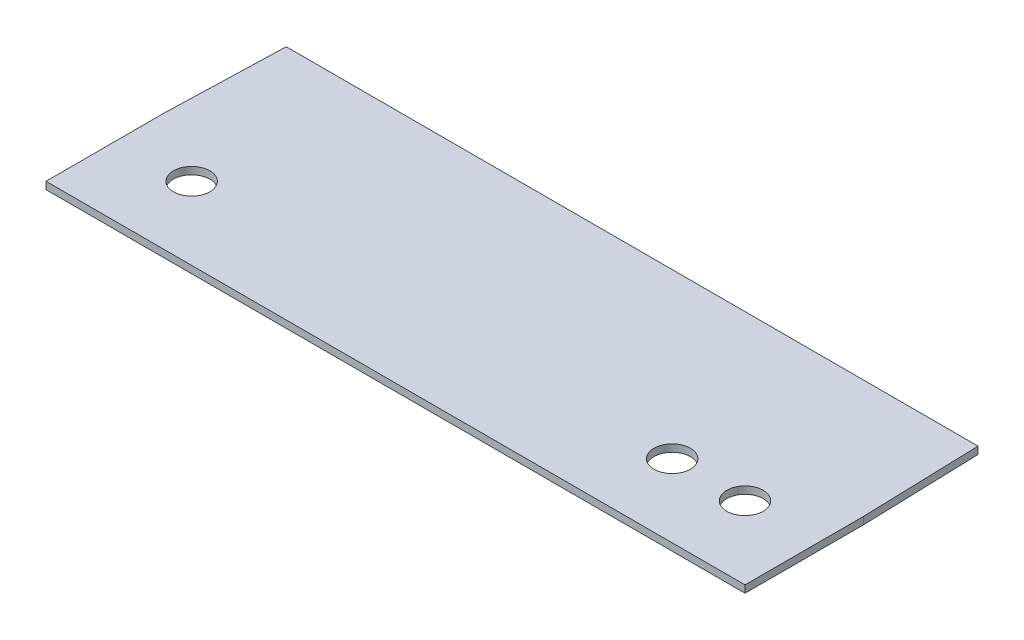
ISO-10303-21;
HEADER;
FILE_DESCRIPTION(('STEP AP214'),'2;1');
FILE_NAME('part.step','',(''),(''),'','','');
FILE_SCHEMA(('AUTOMOTIVE_DESIGN { 1 0 10303 214 1 1 1 1 }'));
ENDSEC;
DATA;
#1=APPLICATION_CONTEXT('core data for automotive mechanical design processes');
#2=APPLICATION_PROTOCOL_DEFINITION('international standard','automotive_design',2000,#1);
#3=PRODUCT_CONTEXT('',#1,'mechanical');
#4=PRODUCT('Part','Part','',(#3));
#5=PRODUCT_RELATED_PRODUCT_CATEGORY('part','',(#4));
#6=PRODUCT_DEFINITION_FORMATION('','',#4);
#7=PRODUCT_DEFINITION_CONTEXT('part definition',#1,'design');
#8=PRODUCT_DEFINITION('design','',#6,#7);
#9=PRODUCT_DEFINITION_SHAPE('','',#8);
#10=(LENGTH_UNIT() NAMED_UNIT(*) SI_UNIT(.MILLI.,.METRE.));
#11=(NAMED_UNIT(*) PLANE_ANGLE_UNIT() SI_UNIT($,.RADIAN.));
#12=(NAMED_UNIT(*) SI_UNIT($,.STERADIAN.) SOLID_ANGLE_UNIT());
#13=UNCERTAINTY_MEASURE_WITH_UNIT(LENGTH_MEASURE(1.E-05),#10,'distance_accuracy_value','');
#14=(GEOMETRIC_REPRESENTATION_CONTEXT(3) GLOBAL_UNCERTAINTY_ASSIGNED_CONTEXT((#13)) GLOBAL_UNIT_ASSIGNED_CONTEXT((#10,
#11,#12)) REPRESENTATION_CONTEXT('',''));
#15=CARTESIAN_POINT('',(0.,0.,0.));
#16=DIRECTION('',(0.,0.,1.));
#17=DIRECTION('',(1.,0.,0.));
#18=AXIS2_PLACEMENT_3D('',#15,#16,#17);
#19=CARTESIAN_POINT('',(96.,2.,0.));
#20=DIRECTION('',(-1.,0.,0.));
#21=DIRECTION('',(0.,0.,1.));
#22=AXIS2_PLACEMENT_3D('',#19,#20,#21);
#23=PLANE('',#22);
#24=DIRECTION('',(0.,0.,-1.));
#25=VECTOR('',#24,1.);
#26=CARTESIAN_POINT('',(96.,0.,0.));
#27=LINE('',#26,#25);
#28=CARTESIAN_POINT('',(96.,0.,32.5));
#29=VERTEX_POINT('',#28);
#30=CARTESIAN_POINT('',(96.,0.,0.));
#31=VERTEX_POINT('',#30);
#32=EDGE_CURVE('E130',#29,#31,#27,.T.);
#33=ORIENTED_EDGE('',*,*,#32,.T.);
#34=DIRECTION('',(0.,-1.,0.));
#35=VECTOR('',#34,1.);
#36=CARTESIAN_POINT('',(96.,2.,0.));
#37=LINE('',#36,#35);
#38=CARTESIAN_POINT('',(96.,2.,0.));
#39=VERTEX_POINT('',#38);
#40=EDGE_CURVE('E11',#39,#31,#37,.T.);
#41=ORIENTED_EDGE('',*,*,#40,.F.);
#42=DIRECTION('',(0.,0.,-1.));
#43=VECTOR('',#42,1.);
#44=CARTESIAN_POINT('',(96.,2.,0.));
#45=LINE('',#44,#43);
#46=CARTESIAN_POINT('',(96.,2.,32.5));
#47=VERTEX_POINT('',#46);
#48=EDGE_CURVE('E146',#47,#39,#45,.T.);
#49=ORIENTED_EDGE('',*,*,#48,.F.);
#50=DIRECTION('',(0.,-1.,0.));
#51=VECTOR('',#50,1.);
#52=CARTESIAN_POINT('',(96.,2.,32.5));
#53=LINE('',#52,#51);
#54=EDGE_CURVE('E126',#47,#29,#53,.T.);
#55=ORIENTED_EDGE('',*,*,#54,.T.);
#56=EDGE_LOOP('',(#33,#41,#49,#55));
#57=FACE_BOUND('',#56,.T.);
#58=ADVANCED_FACE('F39',(#57),#23,.F.);
#59=CARTESIAN_POINT('',(96.,2.,0.));
#60=DIRECTION('',(-0.999526963076654,0.,0.030754675786974));
#61=DIRECTION('',(0.030754675786974,0.,0.999526963076654));
#62=AXIS2_PLACEMENT_3D('',#59,#60,#61);
#63=PLANE('',#62);
#64=DIRECTION('',(-0.030754675786974,0.,-0.999526963076654));
#65=VECTOR('',#64,1.);
#66=CARTESIAN_POINT('',(96.,0.,0.));
#67=LINE('',#66,#65);
#68=CARTESIAN_POINT('',(95.,0.,-32.5));
#69=VERTEX_POINT('',#68);
#70=EDGE_CURVE('E134',#31,#69,#67,.T.);
#71=ORIENTED_EDGE('',*,*,#70,.T.);
#72=DIRECTION('',(0.,-1.,0.));
#73=VECTOR('',#72,1.);
#74=CARTESIAN_POINT('',(95.,2.,-32.5));
#75=LINE('',#74,#73);
#76=CARTESIAN_POINT('',(95.,2.,-32.5));
#77=VERTEX_POINT('',#76);
#78=EDGE_CURVE('E49',#77,#69,#75,.T.);
#79=ORIENTED_EDGE('',*,*,#78,.F.);
#80=DIRECTION('',(-0.030754675786974,0.,-0.999526963076654));
#81=VECTOR('',#80,1.);
#82=CARTESIAN_POINT('',(96.,2.,0.));
#83=LINE('',#82,#81);
#84=EDGE_CURVE('E95',#39,#77,#83,.T.);
#85=ORIENTED_EDGE('',*,*,#84,.F.);
#86=ORIENTED_EDGE('',*,*,#40,.T.);
#87=EDGE_LOOP('',(#71,#79,#85,#86));
#88=FACE_BOUND('',#87,.T.);
#89=ADVANCED_FACE('F184',(#88),#63,.F.);
#90=CARTESIAN_POINT('',(-95.,2.,-32.5));
#91=DIRECTION('',(0.,0.,1.));
#92=DIRECTION('',(1.,0.,0.));
#93=AXIS2_PLACEMENT_3D('',#90,#91,#92);
#94=PLANE('',#93);
#95=DIRECTION('',(-1.,0.,0.));
#96=VECTOR('',#95,1.);
#97=CARTESIAN_POINT('',(-95.,0.,-32.5));
#98=LINE('',#97,#96);
#99=CARTESIAN_POINT('',(-95.,0.,-32.5));
#100=VERTEX_POINT('',#99);
#101=EDGE_CURVE('E137',#69,#100,#98,.T.);
#102=ORIENTED_EDGE('',*,*,#101,.T.);
#103=DIRECTION('',(0.,-1.,0.));
#104=VECTOR('',#103,1.);
#105=CARTESIAN_POINT('',(-95.,2.,-32.5));
#106=LINE('',#105,#104);
#107=CARTESIAN_POINT('',(-95.,2.,-32.5));
#108=VERTEX_POINT('',#107);
#109=EDGE_CURVE('E119',#108,#100,#106,.T.);
#110=ORIENTED_EDGE('',*,*,#109,.F.);
#111=DIRECTION('',(-1.,0.,0.));
#112=VECTOR('',#111,1.);
#113=CARTESIAN_POINT('',(-95.,2.,-32.5));
#114=LINE('',#113,#112);
#115=EDGE_CURVE('E108',#77,#108,#114,.T.);
#116=ORIENTED_EDGE('',*,*,#115,.F.);
#117=ORIENTED_EDGE('',*,*,#78,.T.);
#118=EDGE_LOOP('',(#102,#110,#116,#117));
#119=FACE_BOUND('',#118,.T.);
#120=ADVANCED_FACE('F189',(#119),#94,.F.);
#121=CARTESIAN_POINT('',(-96.,2.,0.));
#122=DIRECTION('',(0.999526963076654,0.,0.030754675786974));
#123=DIRECTION('',(0.030754675786974,0.,-0.999526963076654));
#124=AXIS2_PLACEMENT_3D('',#121,#122,#123);
#125=PLANE('',#124);
#126=DIRECTION('',(-0.030754675786974,0.,0.999526963076654));
#127=VECTOR('',#126,1.);
#128=CARTESIAN_POINT('',(-96.,0.,0.));
#129=LINE('',#128,#127);
#130=CARTESIAN_POINT('',(-96.,0.,0.));
#131=VERTEX_POINT('',#130);
#132=EDGE_CURVE('E117',#100,#131,#129,.T.);
#133=ORIENTED_EDGE('',*,*,#132,.T.);
#134=DIRECTION('',(0.,-1.,0.));
#135=VECTOR('',#134,1.);
#136=CARTESIAN_POINT('',(-96.,2.,0.));
#137=LINE('',#136,#135);
#138=CARTESIAN_POINT('',(-96.,2.,0.));
#139=VERTEX_POINT('',#138);
#140=EDGE_CURVE('E114',#139,#131,#137,.T.);
#141=ORIENTED_EDGE('',*,*,#140,.F.);
#142=DIRECTION('',(-0.030754675786974,0.,0.999526963076654));
#143=VECTOR('',#142,1.);
#144=CARTESIAN_POINT('',(-96.,2.,0.));
#145=LINE('',#144,#143);
#146=EDGE_CURVE('E102',#108,#139,#145,.T.);
#147=ORIENTED_EDGE('',*,*,#146,.F.);
#148=ORIENTED_EDGE('',*,*,#109,.T.);
#149=EDGE_LOOP('',(#133,#141,#147,#148));
#150=FACE_BOUND('',#149,.T.);
#151=ADVANCED_FACE('F115',(#150),#125,.F.);
#152=CARTESIAN_POINT('',(-96.,2.,0.));
#153=DIRECTION('',(1.,0.,0.));
#154=DIRECTION('',(0.,0.,-1.));
#155=AXIS2_PLACEMENT_3D('',#152,#153,#154);
#156=PLANE('',#155);
#157=DIRECTION('',(0.,0.,1.));
#158=VECTOR('',#157,1.);
#159=CARTESIAN_POINT('',(-96.,0.,0.));
#160=LINE('',#159,#158);
#161=CARTESIAN_POINT('',(-96.,0.,32.5));
#162=VERTEX_POINT('',#161);
#163=EDGE_CURVE('E81',#131,#162,#160,.T.);
#164=ORIENTED_EDGE('',*,*,#163,.T.);
#165=DIRECTION('',(0.,-1.,0.));
#166=VECTOR('',#165,1.);
#167=CARTESIAN_POINT('',(-96.,2.,32.5));
#168=LINE('',#167,#166);
#169=CARTESIAN_POINT('',(-96.,2.,32.5));
#170=VERTEX_POINT('',#169);
#171=EDGE_CURVE('E120',#170,#162,#168,.T.);
#172=ORIENTED_EDGE('',*,*,#171,.F.);
#173=DIRECTION('',(0.,0.,1.));
#174=VECTOR('',#173,1.);
#175=CARTESIAN_POINT('',(-96.,2.,0.));
#176=LINE('',#175,#174);
#177=EDGE_CURVE('E106',#139,#170,#176,.T.);
#178=ORIENTED_EDGE('',*,*,#177,.F.);
#179=ORIENTED_EDGE('',*,*,#140,.T.);
#180=EDGE_LOOP('',(#164,#172,#178,#179));
#181=FACE_BOUND('',#180,.T.);
#182=ADVANCED_FACE('F122',(#181),#156,.F.);
#183=CARTESIAN_POINT('',(-96.,2.,32.5));
#184=DIRECTION('',(0.,0.,-1.));
#185=DIRECTION('',(-1.,0.,0.));
#186=AXIS2_PLACEMENT_3D('',#183,#184,#185);
#187=PLANE('',#186);
#188=DIRECTION('',(1.,0.,0.));
#189=VECTOR('',#188,1.);
#190=CARTESIAN_POINT('',(-96.,0.,32.5));
#191=LINE('',#190,#189);
#192=EDGE_CURVE('E87',#162,#29,#191,.T.);
#193=ORIENTED_EDGE('',*,*,#192,.T.);
#194=ORIENTED_EDGE('',*,*,#54,.F.);
#195=DIRECTION('',(1.,0.,0.));
#196=VECTOR('',#195,1.);
#197=CARTESIAN_POINT('',(-96.,2.,32.5));
#198=LINE('',#197,#196);
#199=EDGE_CURVE('E58',#170,#47,#198,.T.);
#200=ORIENTED_EDGE('',*,*,#199,.F.);
#201=ORIENTED_EDGE('',*,*,#171,.T.);
#202=EDGE_LOOP('',(#193,#194,#200,#201));
#203=FACE_BOUND('',#202,.T.);
#204=ADVANCED_FACE('F215',(#203),#187,.F.);
#205=CARTESIAN_POINT('',(0.,2.,0.));
#206=DIRECTION('',(0.,1.,0.));
#207=DIRECTION('',(0.,0.,1.));
#208=AXIS2_PLACEMENT_3D('',#205,#206,#207);
#209=PLANE('',#208);
#210=CARTESIAN_POINT('',(-76.,2.,12.5));
#211=DIRECTION('',(0.,1.,0.));
#212=DIRECTION('',(0.,0.,1.));
#213=AXIS2_PLACEMENT_3D('',#210,#211,#212);
#214=CIRCLE('',#213,5.);
#215=CARTESIAN_POINT('',(-76.,2.,17.5));
#216=VERTEX_POINT('',#215);
#217=EDGE_CURVE('E160',#216,#216,#214,.T.);
#218=ORIENTED_EDGE('',*,*,#217,.F.);
#219=EDGE_LOOP('',(#218));
#220=FACE_BOUND('',#219,.T.);
#221=CARTESIAN_POINT('',(56.,2.,12.5));
#222=DIRECTION('',(0.,1.,0.));
#223=DIRECTION('',(0.,0.,1.));
#224=AXIS2_PLACEMENT_3D('',#221,#222,#223);
#225=CIRCLE('',#224,5.);
#226=CARTESIAN_POINT('',(56.,2.,17.5));
#227=VERTEX_POINT('',#226);
#228=EDGE_CURVE('E206',#227,#227,#225,.T.);
#229=ORIENTED_EDGE('',*,*,#228,.F.);
#230=EDGE_LOOP('',(#229));
#231=FACE_BOUND('',#230,.T.);
#232=CARTESIAN_POINT('',(76.,2.,12.5));
#233=DIRECTION('',(0.,1.,0.));
#234=DIRECTION('',(0.,0.,1.));
#235=AXIS2_PLACEMENT_3D('',#232,#233,#234);
#236=CIRCLE('',#235,5.);
#237=CARTESIAN_POINT('',(76.,2.,17.5));
#238=VERTEX_POINT('',#237);
#239=EDGE_CURVE('E202',#238,#238,#236,.T.);
#240=ORIENTED_EDGE('',*,*,#239,.F.);
#241=EDGE_LOOP('',(#240));
#242=FACE_BOUND('',#241,.T.);
#243=ORIENTED_EDGE('',*,*,#48,.T.);
#244=ORIENTED_EDGE('',*,*,#84,.T.);
#245=ORIENTED_EDGE('',*,*,#115,.T.);
#246=ORIENTED_EDGE('',*,*,#146,.T.);
#247=ORIENTED_EDGE('',*,*,#177,.T.);
#248=ORIENTED_EDGE('',*,*,#199,.T.);
#249=EDGE_LOOP('',(#243,#244,#245,#246,#247,#248));
#250=FACE_BOUND('',#249,.T.);
#251=ADVANCED_FACE('F104',(#220,#231,#242,#250),#209,.T.);
#252=CARTESIAN_POINT('',(0.,0.,0.));
#253=DIRECTION('',(0.,1.,0.));
#254=DIRECTION('',(0.,0.,1.));
#255=AXIS2_PLACEMENT_3D('',#252,#253,#254);
#256=PLANE('',#255);
#257=CARTESIAN_POINT('',(-76.,0.,12.5));
#258=DIRECTION('',(0.,1.,0.));
#259=DIRECTION('',(0.,0.,1.));
#260=AXIS2_PLACEMENT_3D('',#257,#258,#259);
#261=CIRCLE('',#260,5.);
#262=CARTESIAN_POINT('',(-76.,0.,17.5));
#263=VERTEX_POINT('',#262);
#264=EDGE_CURVE('E42',#263,#263,#261,.T.);
#265=ORIENTED_EDGE('',*,*,#264,.T.);
#266=EDGE_LOOP('',(#265));
#267=FACE_BOUND('',#266,.T.);
#268=CARTESIAN_POINT('',(56.,0.,12.5));
#269=DIRECTION('',(0.,1.,0.));
#270=DIRECTION('',(0.,0.,1.));
#271=AXIS2_PLACEMENT_3D('',#268,#269,#270);
#272=CIRCLE('',#271,5.);
#273=CARTESIAN_POINT('',(56.,0.,17.5));
#274=VERTEX_POINT('',#273);
#275=EDGE_CURVE('E159',#274,#274,#272,.T.);
#276=ORIENTED_EDGE('',*,*,#275,.T.);
#277=EDGE_LOOP('',(#276));
#278=FACE_BOUND('',#277,.T.);
#279=CARTESIAN_POINT('',(76.,0.,12.5));
#280=DIRECTION('',(0.,1.,0.));
#281=DIRECTION('',(0.,0.,1.));
#282=AXIS2_PLACEMENT_3D('',#279,#280,#281);
#283=CIRCLE('',#282,5.);
#284=CARTESIAN_POINT('',(76.,0.,17.5));
#285=VERTEX_POINT('',#284);
#286=EDGE_CURVE('E156',#285,#285,#283,.T.);
#287=ORIENTED_EDGE('',*,*,#286,.T.);
#288=EDGE_LOOP('',(#287));
#289=FACE_BOUND('',#288,.T.);
#290=ORIENTED_EDGE('',*,*,#32,.F.);
#291=ORIENTED_EDGE('',*,*,#192,.F.);
#292=ORIENTED_EDGE('',*,*,#163,.F.);
#293=ORIENTED_EDGE('',*,*,#132,.F.);
#294=ORIENTED_EDGE('',*,*,#101,.F.);
#295=ORIENTED_EDGE('',*,*,#70,.F.);
#296=EDGE_LOOP('',(#290,#291,#292,#293,#294,#295));
#297=FACE_BOUND('',#296,.T.);
#298=ADVANCED_FACE('F169',(#267,#278,#289,#297),#256,.F.);
#299=CARTESIAN_POINT('',(76.,-8.,12.5));
#300=DIRECTION('',(0.,1.,0.));
#301=DIRECTION('',(0.,0.,1.));
#302=AXIS2_PLACEMENT_3D('',#299,#300,#301);
#303=CYLINDRICAL_SURFACE('',#302,5.);
#304=ORIENTED_EDGE('',*,*,#239,.T.);
#305=EDGE_LOOP('',(#304));
#306=FACE_BOUND('',#305,.T.);
#307=ORIENTED_EDGE('',*,*,#286,.F.);
#308=EDGE_LOOP('',(#307));
#309=FACE_BOUND('',#308,.T.);
#310=ADVANCED_FACE('F179',(#306,#309),#303,.F.);
#311=CARTESIAN_POINT('',(56.,-8.,12.5));
#312=DIRECTION('',(0.,1.,0.));
#313=DIRECTION('',(0.,0.,1.));
#314=AXIS2_PLACEMENT_3D('',#311,#312,#313);
#315=CYLINDRICAL_SURFACE('',#314,5.);
#316=ORIENTED_EDGE('',*,*,#228,.T.);
#317=EDGE_LOOP('',(#316));
#318=FACE_BOUND('',#317,.T.);
#319=ORIENTED_EDGE('',*,*,#275,.F.);
#320=EDGE_LOOP('',(#319));
#321=FACE_BOUND('',#320,.T.);
#322=ADVANCED_FACE('F173',(#318,#321),#315,.F.);
#323=CARTESIAN_POINT('',(-76.,-8.,12.5));
#324=DIRECTION('',(0.,1.,0.));
#325=DIRECTION('',(0.,0.,1.));
#326=AXIS2_PLACEMENT_3D('',#323,#324,#325);
#327=CYLINDRICAL_SURFACE('',#326,5.);
#328=ORIENTED_EDGE('',*,*,#217,.T.);
#329=EDGE_LOOP('',(#328));
#330=FACE_BOUND('',#329,.T.);
#331=ORIENTED_EDGE('',*,*,#264,.F.);
#332=EDGE_LOOP('',(#331));
#333=FACE_BOUND('',#332,.T.);
#334=ADVANCED_FACE('F171',(#330,#333),#327,.F.);
#335=CLOSED_SHELL('',(#58,#89,#120,#151,#182,#204,#251,#298,#310,#322,#334));
#336=MANIFOLD_SOLID_BREP('B2',#335);
#337=ADVANCED_BREP_SHAPE_REPRESENTATION('',(#18,#336),#14);
#338=SHAPE_DEFINITION_REPRESENTATION(#9,#337);
ENDSEC;
END-ISO-10303-21;
